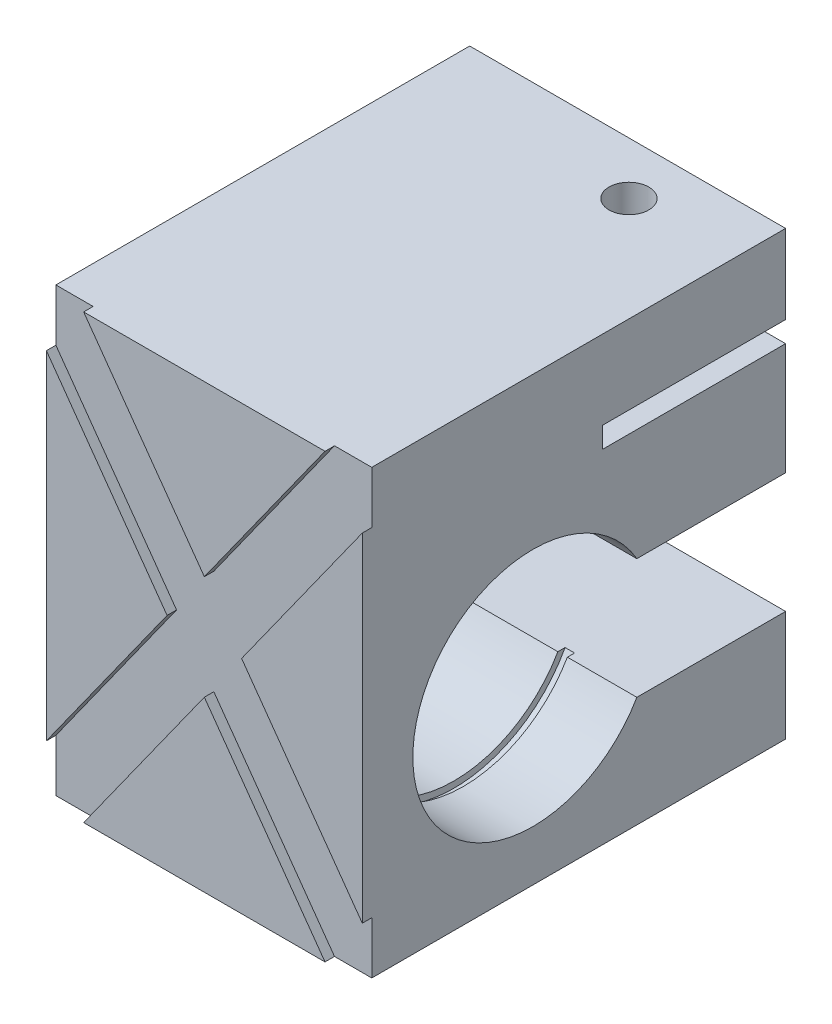
ISO-10303-21;
HEADER;
FILE_DESCRIPTION(('STEP AP214'),'2;1');
FILE_NAME('part.step','',(''),(''),'','','');
FILE_SCHEMA(('AUTOMOTIVE_DESIGN { 1 0 10303 214 1 1 1 1 }'));
ENDSEC;
DATA;
#1=APPLICATION_CONTEXT('core data for automotive mechanical design processes');
#2=APPLICATION_PROTOCOL_DEFINITION('international standard','automotive_design',2000,#1);
#3=PRODUCT_CONTEXT('',#1,'mechanical');
#4=PRODUCT('Part','Part','',(#3));
#5=PRODUCT_RELATED_PRODUCT_CATEGORY('part','',(#4));
#6=PRODUCT_DEFINITION_FORMATION('','',#4);
#7=PRODUCT_DEFINITION_CONTEXT('part definition',#1,'design');
#8=PRODUCT_DEFINITION('design','',#6,#7);
#9=PRODUCT_DEFINITION_SHAPE('','',#8);
#10=(LENGTH_UNIT() NAMED_UNIT(*) SI_UNIT(.MILLI.,.METRE.));
#11=(NAMED_UNIT(*) PLANE_ANGLE_UNIT() SI_UNIT($,.RADIAN.));
#12=(NAMED_UNIT(*) SI_UNIT($,.STERADIAN.) SOLID_ANGLE_UNIT());
#13=UNCERTAINTY_MEASURE_WITH_UNIT(LENGTH_MEASURE(1.E-05),#10,'distance_accuracy_value','');
#14=(GEOMETRIC_REPRESENTATION_CONTEXT(3) GLOBAL_UNCERTAINTY_ASSIGNED_CONTEXT((#13)) GLOBAL_UNIT_ASSIGNED_CONTEXT((#10,
#11,#12)) REPRESENTATION_CONTEXT('',''));
#15=CARTESIAN_POINT('',(0.,0.,0.));
#16=DIRECTION('',(0.,0.,1.));
#17=DIRECTION('',(1.,0.,0.));
#18=AXIS2_PLACEMENT_3D('',#15,#16,#17);
#19=CARTESIAN_POINT('',(0.,27.,6.50000000000001));
#20=DIRECTION('',(1.,0.,0.));
#21=DIRECTION('',(0.,0.,-1.));
#22=AXIS2_PLACEMENT_3D('',#19,#20,#21);
#23=CYLINDRICAL_SURFACE('',#22,19.);
#24=CARTESIAN_POINT('',(12.5,27.,6.50000000000001));
#25=DIRECTION('',(-1.,0.,0.));
#26=DIRECTION('',(0.,0.,-1.));
#27=AXIS2_PLACEMENT_3D('',#24,#25,#26);
#28=CIRCLE('',#27,19.);
#29=CARTESIAN_POINT('',(12.5,17.5,-9.95448267190432));
#30=VERTEX_POINT('',#29);
#31=CARTESIAN_POINT('',(12.5,36.5,-9.95448267190432));
#32=VERTEX_POINT('',#31);
#33=EDGE_CURVE('E618',#30,#32,#28,.T.);
#34=ORIENTED_EDGE('',*,*,#33,.T.);
#35=DIRECTION('',(1.,0.,0.));
#36=VECTOR('',#35,1.);
#37=CARTESIAN_POINT('',(0.,36.5,-9.95448267190432));
#38=LINE('',#37,#36);
#39=CARTESIAN_POINT('',(37.5,36.5,-9.95448267190432));
#40=VERTEX_POINT('',#39);
#41=EDGE_CURVE('E69',#32,#40,#38,.T.);
#42=ORIENTED_EDGE('',*,*,#41,.T.);
#43=CARTESIAN_POINT('',(37.5,27.,6.50000000000001));
#44=DIRECTION('',(-1.,0.,0.));
#45=DIRECTION('',(0.,0.,-1.));
#46=AXIS2_PLACEMENT_3D('',#43,#44,#45);
#47=CIRCLE('',#46,19.);
#48=CARTESIAN_POINT('',(37.5,17.5,-9.95448267190432));
#49=VERTEX_POINT('',#48);
#50=EDGE_CURVE('E595',#49,#40,#47,.T.);
#51=ORIENTED_EDGE('',*,*,#50,.F.);
#52=DIRECTION('',(1.,0.,0.));
#53=VECTOR('',#52,1.);
#54=CARTESIAN_POINT('',(0.,17.5,-9.95448267190432));
#55=LINE('',#54,#53);
#56=EDGE_CURVE('E285',#30,#49,#55,.T.);
#57=ORIENTED_EDGE('',*,*,#56,.F.);
#58=EDGE_LOOP('',(#34,#42,#51,#57));
#59=FACE_BOUND('',#58,.T.);
#60=ADVANCED_FACE('F45',(#59),#23,.F.);
#61=CARTESIAN_POINT('',(0.,36.5,-9.95448267190432));
#62=VERTEX_POINT('',#61);
#63=CARTESIAN_POINT('',(11.,36.5,-9.95448267190432));
#64=VERTEX_POINT('',#63);
#65=EDGE_CURVE('E275',#62,#64,#38,.T.);
#66=ORIENTED_EDGE('',*,*,#65,.T.);
#67=CARTESIAN_POINT('',(11.,27.,6.50000000000001));
#68=DIRECTION('',(-1.,0.,0.));
#69=DIRECTION('',(0.,0.,-1.));
#70=AXIS2_PLACEMENT_3D('',#67,#68,#69);
#71=CIRCLE('',#70,19.);
#72=CARTESIAN_POINT('',(11.,17.5,-9.95448267190432));
#73=VERTEX_POINT('',#72);
#74=EDGE_CURVE('E261',#73,#64,#71,.T.);
#75=ORIENTED_EDGE('',*,*,#74,.F.);
#76=CARTESIAN_POINT('',(0.,17.5,-9.95448267190432));
#77=VERTEX_POINT('',#76);
#78=EDGE_CURVE('E273',#77,#73,#55,.T.);
#79=ORIENTED_EDGE('',*,*,#78,.F.);
#80=CARTESIAN_POINT('',(0.,27.,6.50000000000001));
#81=DIRECTION('',(1.,0.,0.));
#82=DIRECTION('',(0.,0.,-1.));
#83=AXIS2_PLACEMENT_3D('',#80,#81,#82);
#84=CIRCLE('',#83,19.);
#85=EDGE_CURVE('E313',#62,#77,#84,.T.);
#86=ORIENTED_EDGE('',*,*,#85,.F.);
#87=EDGE_LOOP('',(#66,#75,#79,#86));
#88=FACE_BOUND('',#87,.T.);
#89=ADVANCED_FACE('F271',(#88),#23,.F.);
#90=CARTESIAN_POINT('',(0.,70.,33.5));
#91=DIRECTION('',(0.,-1.,0.));
#92=DIRECTION('',(0.,0.,-1.));
#93=AXIS2_PLACEMENT_3D('',#90,#91,#92);
#94=PLANE('',#93);
#95=DIRECTION('',(0.,0.,1.));
#96=VECTOR('',#95,1.);
#97=CARTESIAN_POINT('',(44.1012626740279,70.,32.));
#98=LINE('',#97,#96);
#99=CARTESIAN_POINT('',(44.1012626740279,70.,32.));
#100=VERTEX_POINT('',#99);
#101=CARTESIAN_POINT('',(44.1012626740279,70.,33.5));
#102=VERTEX_POINT('',#101);
#103=EDGE_CURVE('E450',#100,#102,#98,.T.);
#104=ORIENTED_EDGE('',*,*,#103,.F.);
#105=DIRECTION('',(-1.,0.,0.));
#106=VECTOR('',#105,1.);
#107=CARTESIAN_POINT('',(0.,70.,32.));
#108=LINE('',#107,#106);
#109=CARTESIAN_POINT('',(50.,70.,32.));
#110=VERTEX_POINT('',#109);
#111=EDGE_CURVE('E392',#110,#100,#108,.T.);
#112=ORIENTED_EDGE('',*,*,#111,.F.);
#113=DIRECTION('',(0.,0.,-1.));
#114=VECTOR('',#113,1.);
#115=CARTESIAN_POINT('',(50.,70.,33.5));
#116=LINE('',#115,#114);
#117=CARTESIAN_POINT('',(50.,70.,-33.5));
#118=VERTEX_POINT('',#117);
#119=EDGE_CURVE('E518',#110,#118,#116,.T.);
#120=ORIENTED_EDGE('',*,*,#119,.T.);
#121=DIRECTION('',(-1.,0.,0.));
#122=VECTOR('',#121,1.);
#123=CARTESIAN_POINT('',(0.,70.,-33.5));
#124=LINE('',#123,#122);
#125=CARTESIAN_POINT('',(0.,70.,-33.5));
#126=VERTEX_POINT('',#125);
#127=EDGE_CURVE('E485',#118,#126,#124,.T.);
#128=ORIENTED_EDGE('',*,*,#127,.T.);
#129=DIRECTION('',(0.,0.,-1.));
#130=VECTOR('',#129,1.);
#131=CARTESIAN_POINT('',(0.,70.,33.5));
#132=LINE('',#131,#130);
#133=CARTESIAN_POINT('',(0.,70.,32.));
#134=VERTEX_POINT('',#133);
#135=EDGE_CURVE('E497',#134,#126,#132,.T.);
#136=ORIENTED_EDGE('',*,*,#135,.F.);
#137=DIRECTION('',(-1.,0.,0.));
#138=VECTOR('',#137,1.);
#139=CARTESIAN_POINT('',(0.,70.,32.));
#140=LINE('',#139,#138);
#141=CARTESIAN_POINT('',(5.89873732597207,70.,32.));
#142=VERTEX_POINT('',#141);
#143=EDGE_CURVE('E403',#142,#134,#140,.T.);
#144=ORIENTED_EDGE('',*,*,#143,.F.);
#145=DIRECTION('',(0.,0.,1.));
#146=VECTOR('',#145,1.);
#147=CARTESIAN_POINT('',(5.89873732597207,70.,32.));
#148=LINE('',#147,#146);
#149=CARTESIAN_POINT('',(5.89873732597207,70.,33.5));
#150=VERTEX_POINT('',#149);
#151=EDGE_CURVE('E443',#142,#150,#148,.T.);
#152=ORIENTED_EDGE('',*,*,#151,.T.);
#153=DIRECTION('',(-1.,0.,0.));
#154=VECTOR('',#153,1.);
#155=CARTESIAN_POINT('',(0.,70.,33.5));
#156=LINE('',#155,#154);
#157=EDGE_CURVE('E493',#102,#150,#156,.T.);
#158=ORIENTED_EDGE('',*,*,#157,.F.);
#159=EDGE_LOOP('',(#104,#112,#120,#128,#136,#144,#152,#158));
#160=FACE_BOUND('',#159,.T.);
#161=CARTESIAN_POINT('',(33.5,70.,-25.2));
#162=DIRECTION('',(0.,1.,0.));
#163=DIRECTION('',(0.,0.,1.));
#164=AXIS2_PLACEMENT_3D('',#161,#162,#163);
#165=CIRCLE('',#164,3.14999999999999);
#166=CARTESIAN_POINT('',(33.5,70.,-22.05));
#167=VERTEX_POINT('',#166);
#168=EDGE_CURVE('E561',#167,#167,#165,.T.);
#169=ORIENTED_EDGE('',*,*,#168,.F.);
#170=EDGE_LOOP('',(#169));
#171=FACE_BOUND('',#170,.T.);
#172=ADVANCED_FACE('F666',(#160,#171),#94,.F.);
#173=CARTESIAN_POINT('',(0.,0.,-33.5));
#174=DIRECTION('',(0.,0.,-1.));
#175=DIRECTION('',(-1.,0.,0.));
#176=AXIS2_PLACEMENT_3D('',#173,#174,#175);
#177=PLANE('',#176);
#178=DIRECTION('',(1.,0.,0.));
#179=VECTOR('',#178,1.);
#180=CARTESIAN_POINT('',(0.,17.5,-33.5));
#181=LINE('',#180,#179);
#182=CARTESIAN_POINT('',(0.,17.5,-33.5));
#183=VERTEX_POINT('',#182);
#184=CARTESIAN_POINT('',(50.,17.5,-33.5));
#185=VERTEX_POINT('',#184);
#186=EDGE_CURVE('E284',#183,#185,#181,.T.);
#187=ORIENTED_EDGE('',*,*,#186,.T.);
#188=DIRECTION('',(0.,1.,0.));
#189=VECTOR('',#188,1.);
#190=CARTESIAN_POINT('',(50.,0.,-33.5));
#191=LINE('',#190,#189);
#192=CARTESIAN_POINT('',(50.,0.,-33.5));
#193=VERTEX_POINT('',#192);
#194=EDGE_CURVE('E508',#193,#185,#191,.T.);
#195=ORIENTED_EDGE('',*,*,#194,.F.);
#196=DIRECTION('',(1.,0.,0.));
#197=VECTOR('',#196,1.);
#198=CARTESIAN_POINT('',(0.,0.,-33.5));
#199=LINE('',#198,#197);
#200=CARTESIAN_POINT('',(0.,0.,-33.5));
#201=VERTEX_POINT('',#200);
#202=EDGE_CURVE('E502',#201,#193,#199,.T.);
#203=ORIENTED_EDGE('',*,*,#202,.F.);
#204=DIRECTION('',(0.,-1.,0.));
#205=VECTOR('',#204,1.);
#206=CARTESIAN_POINT('',(0.,0.,-33.5));
#207=LINE('',#206,#205);
#208=EDGE_CURVE('E442',#183,#201,#207,.T.);
#209=ORIENTED_EDGE('',*,*,#208,.F.);
#210=EDGE_LOOP('',(#187,#195,#203,#209));
#211=FACE_BOUND('',#210,.T.);
#212=ADVANCED_FACE('F538',(#211),#177,.T.);
#213=DIRECTION('',(1.,0.,0.));
#214=VECTOR('',#213,1.);
#215=CARTESIAN_POINT('',(0.,57.5,-33.5));
#216=LINE('',#215,#214);
#217=CARTESIAN_POINT('',(0.,57.5,-33.5));
#218=VERTEX_POINT('',#217);
#219=CARTESIAN_POINT('',(50.,57.5,-33.5));
#220=VERTEX_POINT('',#219);
#221=EDGE_CURVE('E344',#218,#220,#216,.T.);
#222=ORIENTED_EDGE('',*,*,#221,.F.);
#223=EDGE_CURVE('E498',#126,#218,#207,.T.);
#224=ORIENTED_EDGE('',*,*,#223,.F.);
#225=ORIENTED_EDGE('',*,*,#127,.F.);
#226=EDGE_CURVE('E507',#220,#118,#191,.T.);
#227=ORIENTED_EDGE('',*,*,#226,.F.);
#228=EDGE_LOOP('',(#222,#224,#225,#227));
#229=FACE_BOUND('',#228,.T.);
#230=ADVANCED_FACE('F661',(#229),#177,.T.);
#231=CARTESIAN_POINT('',(0.,0.,33.5));
#232=DIRECTION('',(1.,0.,0.));
#233=DIRECTION('',(0.,0.,-1.));
#234=AXIS2_PLACEMENT_3D('',#231,#232,#233);
#235=PLANE('',#234);
#236=ORIENTED_EDGE('',*,*,#85,.T.);
#237=DIRECTION('',(0.,0.,-1.));
#238=VECTOR('',#237,1.);
#239=CARTESIAN_POINT('',(0.,17.5,-9.95448267190432));
#240=LINE('',#239,#238);
#241=EDGE_CURVE('E281',#77,#183,#240,.T.);
#242=ORIENTED_EDGE('',*,*,#241,.T.);
#243=ORIENTED_EDGE('',*,*,#208,.T.);
#244=DIRECTION('',(0.,0.,-1.));
#245=VECTOR('',#244,1.);
#246=CARTESIAN_POINT('',(0.,0.,33.5));
#247=LINE('',#246,#245);
#248=CARTESIAN_POINT('',(0.,0.,32.));
#249=VERTEX_POINT('',#248);
#250=EDGE_CURVE('E11',#249,#201,#247,.T.);
#251=ORIENTED_EDGE('',*,*,#250,.F.);
#252=DIRECTION('',(0.,-1.,0.));
#253=VECTOR('',#252,1.);
#254=CARTESIAN_POINT('',(0.,0.,32.));
#255=LINE('',#254,#253);
#256=CARTESIAN_POINT('',(0.,8.25823225636094,32.));
#257=VERTEX_POINT('',#256);
#258=EDGE_CURVE('E360',#257,#249,#255,.T.);
#259=ORIENTED_EDGE('',*,*,#258,.F.);
#260=DIRECTION('',(0.,0.,1.));
#261=VECTOR('',#260,1.);
#262=CARTESIAN_POINT('',(0.,8.25823225636094,32.));
#263=LINE('',#262,#261);
#264=CARTESIAN_POINT('',(0.,8.25823225636094,33.5));
#265=VERTEX_POINT('',#264);
#266=EDGE_CURVE('E473',#257,#265,#263,.T.);
#267=ORIENTED_EDGE('',*,*,#266,.T.);
#268=DIRECTION('',(0.,-1.,0.));
#269=VECTOR('',#268,1.);
#270=CARTESIAN_POINT('',(0.,0.,33.5));
#271=LINE('',#270,#269);
#272=CARTESIAN_POINT('',(0.,61.7417677436391,33.5));
#273=VERTEX_POINT('',#272);
#274=EDGE_CURVE('E480',#273,#265,#271,.T.);
#275=ORIENTED_EDGE('',*,*,#274,.F.);
#276=DIRECTION('',(0.,0.,1.));
#277=VECTOR('',#276,1.);
#278=CARTESIAN_POINT('',(0.,61.7417677436391,32.));
#279=LINE('',#278,#277);
#280=CARTESIAN_POINT('',(0.,61.7417677436391,32.));
#281=VERTEX_POINT('',#280);
#282=EDGE_CURVE('E439',#281,#273,#279,.T.);
#283=ORIENTED_EDGE('',*,*,#282,.F.);
#284=DIRECTION('',(0.,-1.,0.));
#285=VECTOR('',#284,1.);
#286=CARTESIAN_POINT('',(0.,0.,32.));
#287=LINE('',#286,#285);
#288=EDGE_CURVE('E406',#134,#281,#287,.T.);
#289=ORIENTED_EDGE('',*,*,#288,.F.);
#290=ORIENTED_EDGE('',*,*,#135,.T.);
#291=ORIENTED_EDGE('',*,*,#223,.T.);
#292=DIRECTION('',(0.,0.,1.));
#293=VECTOR('',#292,1.);
#294=CARTESIAN_POINT('',(0.,57.5,-4.50000000000001));
#295=LINE('',#294,#293);
#296=CARTESIAN_POINT('',(0.,57.5,-4.50000000000001));
#297=VERTEX_POINT('',#296);
#298=EDGE_CURVE('E325',#218,#297,#295,.T.);
#299=ORIENTED_EDGE('',*,*,#298,.T.);
#300=DIRECTION('',(0.,-1.,0.));
#301=VECTOR('',#300,1.);
#302=CARTESIAN_POINT('',(0.,57.5,-4.50000000000001));
#303=LINE('',#302,#301);
#304=CARTESIAN_POINT('',(0.,54.2,-4.50000000000001));
#305=VERTEX_POINT('',#304);
#306=EDGE_CURVE('E316',#297,#305,#303,.T.);
#307=ORIENTED_EDGE('',*,*,#306,.T.);
#308=DIRECTION('',(0.,0.,-1.));
#309=VECTOR('',#308,1.);
#310=CARTESIAN_POINT('',(0.,54.2,-4.50000000000001));
#311=LINE('',#310,#309);
#312=CARTESIAN_POINT('',(0.,54.2,-33.5));
#313=VERTEX_POINT('',#312);
#314=EDGE_CURVE('E320',#305,#313,#311,.T.);
#315=ORIENTED_EDGE('',*,*,#314,.T.);
#316=CARTESIAN_POINT('',(0.,36.5,-33.5));
#317=VERTEX_POINT('',#316);
#318=EDGE_CURVE('E503',#313,#317,#207,.T.);
#319=ORIENTED_EDGE('',*,*,#318,.T.);
#320=DIRECTION('',(0.,0.,1.));
#321=VECTOR('',#320,1.);
#322=CARTESIAN_POINT('',(0.,36.5,-33.5));
#323=LINE('',#322,#321);
#324=EDGE_CURVE('E543',#317,#62,#323,.T.);
#325=ORIENTED_EDGE('',*,*,#324,.T.);
#326=EDGE_LOOP('',(#236,#242,#243,#251,#259,#267,#275,#283,#289,#290,#291,#299,#307,#315,#319,#325));
#327=FACE_BOUND('',#326,.T.);
#328=ADVANCED_FACE('F47',(#327),#235,.F.);
#329=CARTESIAN_POINT('',(0.,0.,33.5));
#330=DIRECTION('',(0.,1.,0.));
#331=DIRECTION('',(0.,0.,1.));
#332=AXIS2_PLACEMENT_3D('',#329,#330,#331);
#333=PLANE('',#332);
#334=DIRECTION('',(1.,0.,0.));
#335=VECTOR('',#334,1.);
#336=CARTESIAN_POINT('',(0.,0.,33.5));
#337=LINE('',#336,#335);
#338=CARTESIAN_POINT('',(5.89873732597205,0.,33.5));
#339=VERTEX_POINT('',#338);
#340=CARTESIAN_POINT('',(44.1012626740279,0.,33.5));
#341=VERTEX_POINT('',#340);
#342=EDGE_CURVE('E484',#339,#341,#337,.T.);
#343=ORIENTED_EDGE('',*,*,#342,.F.);
#344=DIRECTION('',(0.,0.,1.));
#345=VECTOR('',#344,1.);
#346=CARTESIAN_POINT('',(5.89873732597205,0.,32.));
#347=LINE('',#346,#345);
#348=CARTESIAN_POINT('',(5.89873732597205,0.,32.));
#349=VERTEX_POINT('',#348);
#350=EDGE_CURVE('E470',#349,#339,#347,.T.);
#351=ORIENTED_EDGE('',*,*,#350,.F.);
#352=DIRECTION('',(1.,0.,0.));
#353=VECTOR('',#352,1.);
#354=CARTESIAN_POINT('',(0.,0.,32.));
#355=LINE('',#354,#353);
#356=EDGE_CURVE('E363',#249,#349,#355,.T.);
#357=ORIENTED_EDGE('',*,*,#356,.F.);
#358=ORIENTED_EDGE('',*,*,#250,.T.);
#359=ORIENTED_EDGE('',*,*,#202,.T.);
#360=DIRECTION('',(0.,0.,-1.));
#361=VECTOR('',#360,1.);
#362=CARTESIAN_POINT('',(50.,0.,33.5));
#363=LINE('',#362,#361);
#364=CARTESIAN_POINT('',(50.,0.,32.));
#365=VERTEX_POINT('',#364);
#366=EDGE_CURVE('E54',#365,#193,#363,.T.);
#367=ORIENTED_EDGE('',*,*,#366,.F.);
#368=DIRECTION('',(1.,0.,0.));
#369=VECTOR('',#368,1.);
#370=CARTESIAN_POINT('',(0.,0.,32.));
#371=LINE('',#370,#369);
#372=CARTESIAN_POINT('',(44.1012626740279,0.,32.));
#373=VERTEX_POINT('',#372);
#374=EDGE_CURVE('E374',#373,#365,#371,.T.);
#375=ORIENTED_EDGE('',*,*,#374,.F.);
#376=DIRECTION('',(0.,0.,1.));
#377=VECTOR('',#376,1.);
#378=CARTESIAN_POINT('',(44.1012626740279,0.,32.));
#379=LINE('',#378,#377);
#380=EDGE_CURVE('E463',#373,#341,#379,.T.);
#381=ORIENTED_EDGE('',*,*,#380,.T.);
#382=EDGE_LOOP('',(#343,#351,#357,#358,#359,#367,#375,#381));
#383=FACE_BOUND('',#382,.T.);
#384=ADVANCED_FACE('F533',(#383),#333,.F.);
#385=CARTESIAN_POINT('',(0.,0.,33.5));
#386=DIRECTION('',(0.,0.,-1.));
#387=DIRECTION('',(-1.,0.,0.));
#388=AXIS2_PLACEMENT_3D('',#385,#386,#387);
#389=PLANE('',#388);
#390=ORIENTED_EDGE('',*,*,#157,.T.);
#391=DIRECTION('',(-0.581238193719096,0.813733471206735,0.));
#392=VECTOR('',#391,1.);
#393=CARTESIAN_POINT('',(37.0140287699004,26.4385919785003,33.5));
#394=LINE('',#393,#392);
#395=CARTESIAN_POINT('',(25.,43.2582322563609,33.5));
#396=VERTEX_POINT('',#395);
#397=EDGE_CURVE('E357',#396,#150,#394,.T.);
#398=ORIENTED_EDGE('',*,*,#397,.F.);
#399=DIRECTION('',(0.581238193719097,0.813733471206735,0.));
#400=VECTOR('',#399,1.);
#401=CARTESIAN_POINT('',(-3.90592066179234,2.78994332985167,33.5));
#402=LINE('',#401,#400);
#403=EDGE_CURVE('E433',#396,#102,#402,.T.);
#404=ORIENTED_EDGE('',*,*,#403,.T.);
#405=EDGE_LOOP('',(#390,#398,#404));
#406=FACE_BOUND('',#405,.T.);
#407=ADVANCED_FACE('F711',(#406),#389,.F.);
#408=DIRECTION('',(-0.581238193719096,0.813733471206735,0.));
#409=VECTOR('',#408,1.);
#410=CARTESIAN_POINT('',(29.2021874463158,20.858705318797,33.5));
#411=LINE('',#410,#409);
#412=CARTESIAN_POINT('',(25.,26.7417677436391,33.5));
#413=VERTEX_POINT('',#412);
#414=EDGE_CURVE('E422',#341,#413,#411,.T.);
#415=ORIENTED_EDGE('',*,*,#414,.T.);
#416=DIRECTION('',(0.581238193719097,0.813733471206735,0.));
#417=VECTOR('',#416,1.);
#418=CARTESIAN_POINT('',(3.9059206617923,-2.78994332985165,33.5));
#419=LINE('',#418,#417);
#420=EDGE_CURVE('E418',#339,#413,#419,.T.);
#421=ORIENTED_EDGE('',*,*,#420,.F.);
#422=ORIENTED_EDGE('',*,*,#342,.T.);
#423=EDGE_LOOP('',(#415,#421,#422));
#424=FACE_BOUND('',#423,.T.);
#425=ADVANCED_FACE('F690',(#424),#389,.F.);
#426=DIRECTION('',(-0.581238193719096,0.813733471206735,0.));
#427=VECTOR('',#426,1.);
#428=CARTESIAN_POINT('',(29.2021874463158,20.858705318797,33.5));
#429=LINE('',#428,#427);
#430=CARTESIAN_POINT('',(19.1012626740279,35.,33.5));
#431=VERTEX_POINT('',#430);
#432=EDGE_CURVE('E343',#431,#273,#429,.T.);
#433=ORIENTED_EDGE('',*,*,#432,.T.);
#434=ORIENTED_EDGE('',*,*,#274,.T.);
#435=DIRECTION('',(0.581238193719097,0.813733471206735,0.));
#436=VECTOR('',#435,1.);
#437=CARTESIAN_POINT('',(-3.90592066179234,2.78994332985167,33.5));
#438=LINE('',#437,#436);
#439=EDGE_CURVE('E414',#265,#431,#438,.T.);
#440=ORIENTED_EDGE('',*,*,#439,.T.);
#441=EDGE_LOOP('',(#433,#434,#440));
#442=FACE_BOUND('',#441,.T.);
#443=ADVANCED_FACE('F704',(#442),#389,.F.);
#444=CARTESIAN_POINT('',(50.,0.,33.5));
#445=DIRECTION('',(-1.,0.,0.));
#446=DIRECTION('',(0.,0.,1.));
#447=AXIS2_PLACEMENT_3D('',#444,#445,#446);
#448=PLANE('',#447);
#449=ORIENTED_EDGE('',*,*,#194,.T.);
#450=DIRECTION('',(0.,0.,-1.));
#451=VECTOR('',#450,1.);
#452=CARTESIAN_POINT('',(50.,17.5,-9.95448267190432));
#453=LINE('',#452,#451);
#454=CARTESIAN_POINT('',(50.,17.5,-9.95448267190432));
#455=VERTEX_POINT('',#454);
#456=EDGE_CURVE('E539',#455,#185,#453,.T.);
#457=ORIENTED_EDGE('',*,*,#456,.F.);
#458=CARTESIAN_POINT('',(50.,27.,6.50000000000001));
#459=DIRECTION('',(1.,0.,0.));
#460=DIRECTION('',(0.,0.,-1.));
#461=AXIS2_PLACEMENT_3D('',#458,#459,#460);
#462=CIRCLE('',#461,19.);
#463=CARTESIAN_POINT('',(50.,36.5,-9.95448267190432));
#464=VERTEX_POINT('',#463);
#465=EDGE_CURVE('E553',#464,#455,#462,.T.);
#466=ORIENTED_EDGE('',*,*,#465,.F.);
#467=DIRECTION('',(0.,0.,1.));
#468=VECTOR('',#467,1.);
#469=CARTESIAN_POINT('',(50.,36.5,-33.5));
#470=LINE('',#469,#468);
#471=CARTESIAN_POINT('',(50.,36.5,-33.5));
#472=VERTEX_POINT('',#471);
#473=EDGE_CURVE('E550',#472,#464,#470,.T.);
#474=ORIENTED_EDGE('',*,*,#473,.F.);
#475=CARTESIAN_POINT('',(50.,54.2,-33.5));
#476=VERTEX_POINT('',#475);
#477=EDGE_CURVE('E512',#472,#476,#191,.T.);
#478=ORIENTED_EDGE('',*,*,#477,.T.);
#479=DIRECTION('',(0.,0.,-1.));
#480=VECTOR('',#479,1.);
#481=CARTESIAN_POINT('',(50.,54.2,-4.50000000000001));
#482=LINE('',#481,#480);
#483=CARTESIAN_POINT('',(50.,54.2,-4.50000000000001));
#484=VERTEX_POINT('',#483);
#485=EDGE_CURVE('E333',#484,#476,#482,.T.);
#486=ORIENTED_EDGE('',*,*,#485,.F.);
#487=DIRECTION('',(0.,-1.,0.));
#488=VECTOR('',#487,1.);
#489=CARTESIAN_POINT('',(50.,57.5,-4.50000000000001));
#490=LINE('',#489,#488);
#491=CARTESIAN_POINT('',(50.,57.5,-4.50000000000001));
#492=VERTEX_POINT('',#491);
#493=EDGE_CURVE('E291',#492,#484,#490,.T.);
#494=ORIENTED_EDGE('',*,*,#493,.F.);
#495=DIRECTION('',(0.,0.,1.));
#496=VECTOR('',#495,1.);
#497=CARTESIAN_POINT('',(50.,57.5,-4.50000000000001));
#498=LINE('',#497,#496);
#499=EDGE_CURVE('E321',#220,#492,#498,.T.);
#500=ORIENTED_EDGE('',*,*,#499,.F.);
#501=ORIENTED_EDGE('',*,*,#226,.T.);
#502=ORIENTED_EDGE('',*,*,#119,.F.);
#503=DIRECTION('',(0.,1.,0.));
#504=VECTOR('',#503,1.);
#505=CARTESIAN_POINT('',(50.,0.,32.));
#506=LINE('',#505,#504);
#507=CARTESIAN_POINT('',(50.,61.7417677436391,32.));
#508=VERTEX_POINT('',#507);
#509=EDGE_CURVE('E389',#508,#110,#506,.T.);
#510=ORIENTED_EDGE('',*,*,#509,.F.);
#511=DIRECTION('',(0.,0.,1.));
#512=VECTOR('',#511,1.);
#513=CARTESIAN_POINT('',(50.,61.7417677436391,32.));
#514=LINE('',#513,#512);
#515=CARTESIAN_POINT('',(50.,61.7417677436391,33.5));
#516=VERTEX_POINT('',#515);
#517=EDGE_CURVE('E453',#508,#516,#514,.T.);
#518=ORIENTED_EDGE('',*,*,#517,.T.);
#519=DIRECTION('',(0.,1.,0.));
#520=VECTOR('',#519,1.);
#521=CARTESIAN_POINT('',(50.,0.,33.5));
#522=LINE('',#521,#520);
#523=CARTESIAN_POINT('',(50.,8.25823225636088,33.5));
#524=VERTEX_POINT('',#523);
#525=EDGE_CURVE('E489',#524,#516,#522,.T.);
#526=ORIENTED_EDGE('',*,*,#525,.F.);
#527=DIRECTION('',(0.,0.,1.));
#528=VECTOR('',#527,1.);
#529=CARTESIAN_POINT('',(50.,8.25823225636088,32.));
#530=LINE('',#529,#528);
#531=CARTESIAN_POINT('',(50.,8.25823225636088,32.));
#532=VERTEX_POINT('',#531);
#533=EDGE_CURVE('E460',#532,#524,#530,.T.);
#534=ORIENTED_EDGE('',*,*,#533,.F.);
#535=DIRECTION('',(0.,1.,0.));
#536=VECTOR('',#535,1.);
#537=CARTESIAN_POINT('',(50.,0.,32.));
#538=LINE('',#537,#536);
#539=EDGE_CURVE('E377',#365,#532,#538,.T.);
#540=ORIENTED_EDGE('',*,*,#539,.F.);
#541=ORIENTED_EDGE('',*,*,#366,.T.);
#542=EDGE_LOOP('',(#449,#457,#466,#474,#478,#486,#494,#500,#501,#502,#510,#518,#526,#534,#540,#541));
#543=FACE_BOUND('',#542,.T.);
#544=ADVANCED_FACE('F525',(#543),#448,.F.);
#545=ORIENTED_EDGE('',*,*,#525,.T.);
#546=DIRECTION('',(0.581238193719097,0.813733471206735,0.));
#547=VECTOR('',#546,1.);
#548=CARTESIAN_POINT('',(3.9059206617923,-2.78994332985165,33.5));
#549=LINE('',#548,#547);
#550=CARTESIAN_POINT('',(30.8987373259721,35.,33.5));
#551=VERTEX_POINT('',#550);
#552=EDGE_CURVE('E430',#551,#516,#549,.T.);
#553=ORIENTED_EDGE('',*,*,#552,.F.);
#554=DIRECTION('',(-0.581238193719096,0.813733471206735,0.));
#555=VECTOR('',#554,1.);
#556=CARTESIAN_POINT('',(37.0140287699004,26.4385919785003,33.5));
#557=LINE('',#556,#555);
#558=EDGE_CURVE('E426',#524,#551,#557,.T.);
#559=ORIENTED_EDGE('',*,*,#558,.F.);
#560=EDGE_LOOP('',(#545,#553,#559));
#561=FACE_BOUND('',#560,.T.);
#562=ADVANCED_FACE('F682',(#561),#389,.F.);
#563=DIRECTION('',(1.,0.,0.));
#564=VECTOR('',#563,1.);
#565=CARTESIAN_POINT('',(0.,36.5,-33.5));
#566=LINE('',#565,#564);
#567=EDGE_CURVE('E303',#317,#472,#566,.T.);
#568=ORIENTED_EDGE('',*,*,#567,.F.);
#569=ORIENTED_EDGE('',*,*,#318,.F.);
#570=DIRECTION('',(1.,0.,0.));
#571=VECTOR('',#570,1.);
#572=CARTESIAN_POINT('',(0.,54.2,-33.5));
#573=LINE('',#572,#571);
#574=EDGE_CURVE('E347',#313,#476,#573,.T.);
#575=ORIENTED_EDGE('',*,*,#574,.T.);
#576=ORIENTED_EDGE('',*,*,#477,.F.);
#577=EDGE_LOOP('',(#568,#569,#575,#576));
#578=FACE_BOUND('',#577,.T.);
#579=ADVANCED_FACE('F640',(#578),#177,.T.);
#580=CARTESIAN_POINT('',(29.2021874463158,20.858705318797,32.));
#581=DIRECTION('',(0.813733471206735,0.581238193719096,0.));
#582=DIRECTION('',(-0.581238193719096,0.813733471206735,0.));
#583=AXIS2_PLACEMENT_3D('',#580,#581,#582);
#584=PLANE('',#583);
#585=ORIENTED_EDGE('',*,*,#432,.F.);
#586=DIRECTION('',(0.,0.,1.));
#587=VECTOR('',#586,1.);
#588=CARTESIAN_POINT('',(19.1012626740279,35.,32.));
#589=LINE('',#588,#587);
#590=CARTESIAN_POINT('',(19.1012626740279,35.,32.));
#591=VERTEX_POINT('',#590);
#592=EDGE_CURVE('E410',#591,#431,#589,.T.);
#593=ORIENTED_EDGE('',*,*,#592,.F.);
#594=DIRECTION('',(-0.581238193719096,0.813733471206735,0.));
#595=VECTOR('',#594,1.);
#596=CARTESIAN_POINT('',(29.2021874463158,20.858705318797,32.));
#597=LINE('',#596,#595);
#598=EDGE_CURVE('E353',#591,#281,#597,.T.);
#599=ORIENTED_EDGE('',*,*,#598,.T.);
#600=ORIENTED_EDGE('',*,*,#282,.T.);
#601=EDGE_LOOP('',(#585,#593,#599,#600));
#602=FACE_BOUND('',#601,.T.);
#603=ADVANCED_FACE('F701',(#602),#584,.T.);
#604=CARTESIAN_POINT('',(37.0140287699004,26.4385919785003,32.));
#605=DIRECTION('',(0.813733471206735,0.581238193719096,0.));
#606=DIRECTION('',(-0.581238193719096,0.813733471206735,0.));
#607=AXIS2_PLACEMENT_3D('',#604,#605,#606);
#608=PLANE('',#607);
#609=ORIENTED_EDGE('',*,*,#397,.T.);
#610=ORIENTED_EDGE('',*,*,#151,.F.);
#611=DIRECTION('',(-0.581238193719096,0.813733471206735,0.));
#612=VECTOR('',#611,1.);
#613=CARTESIAN_POINT('',(37.0140287699004,26.4385919785003,32.));
#614=LINE('',#613,#612);
#615=CARTESIAN_POINT('',(25.,43.2582322563609,32.));
#616=VERTEX_POINT('',#615);
#617=EDGE_CURVE('E399',#616,#142,#614,.T.);
#618=ORIENTED_EDGE('',*,*,#617,.F.);
#619=DIRECTION('',(0.,0.,1.));
#620=VECTOR('',#619,1.);
#621=CARTESIAN_POINT('',(25.,43.2582322563609,32.));
#622=LINE('',#621,#620);
#623=EDGE_CURVE('E447',#616,#396,#622,.T.);
#624=ORIENTED_EDGE('',*,*,#623,.T.);
#625=EDGE_LOOP('',(#609,#610,#618,#624));
#626=FACE_BOUND('',#625,.T.);
#627=ADVANCED_FACE('F715',(#626),#608,.F.);
#628=CARTESIAN_POINT('',(-3.90592066179234,2.78994332985167,32.));
#629=DIRECTION('',(0.813733471206735,-0.581238193719096,0.));
#630=DIRECTION('',(0.581238193719096,0.813733471206735,0.));
#631=AXIS2_PLACEMENT_3D('',#628,#629,#630);
#632=PLANE('',#631);
#633=ORIENTED_EDGE('',*,*,#403,.F.);
#634=ORIENTED_EDGE('',*,*,#623,.F.);
#635=DIRECTION('',(0.581238193719097,0.813733471206735,0.));
#636=VECTOR('',#635,1.);
#637=CARTESIAN_POINT('',(-3.90592066179234,2.78994332985167,32.));
#638=LINE('',#637,#636);
#639=EDGE_CURVE('E396',#616,#100,#638,.T.);
#640=ORIENTED_EDGE('',*,*,#639,.T.);
#641=ORIENTED_EDGE('',*,*,#103,.T.);
#642=EDGE_LOOP('',(#633,#634,#640,#641));
#643=FACE_BOUND('',#642,.T.);
#644=ADVANCED_FACE('F714',(#643),#632,.T.);
#645=CARTESIAN_POINT('',(3.9059206617923,-2.78994332985165,32.));
#646=DIRECTION('',(0.813733471206735,-0.581238193719097,0.));
#647=DIRECTION('',(0.581238193719097,0.813733471206735,0.));
#648=AXIS2_PLACEMENT_3D('',#645,#646,#647);
#649=PLANE('',#648);
#650=ORIENTED_EDGE('',*,*,#552,.T.);
#651=ORIENTED_EDGE('',*,*,#517,.F.);
#652=DIRECTION('',(0.581238193719097,0.813733471206735,0.));
#653=VECTOR('',#652,1.);
#654=CARTESIAN_POINT('',(3.9059206617923,-2.78994332985165,32.));
#655=LINE('',#654,#653);
#656=CARTESIAN_POINT('',(30.8987373259721,35.,32.));
#657=VERTEX_POINT('',#656);
#658=EDGE_CURVE('E385',#657,#508,#655,.T.);
#659=ORIENTED_EDGE('',*,*,#658,.F.);
#660=DIRECTION('',(0.,0.,1.));
#661=VECTOR('',#660,1.);
#662=CARTESIAN_POINT('',(30.8987373259721,35.,32.));
#663=LINE('',#662,#661);
#664=EDGE_CURVE('E457',#657,#551,#663,.T.);
#665=ORIENTED_EDGE('',*,*,#664,.T.);
#666=EDGE_LOOP('',(#650,#651,#659,#665));
#667=FACE_BOUND('',#666,.T.);
#668=ADVANCED_FACE('F678',(#667),#649,.F.);
#669=CARTESIAN_POINT('',(37.0140287699004,26.4385919785003,32.));
#670=DIRECTION('',(0.813733471206735,0.581238193719096,0.));
#671=DIRECTION('',(-0.581238193719096,0.813733471206735,0.));
#672=AXIS2_PLACEMENT_3D('',#669,#670,#671);
#673=PLANE('',#672);
#674=ORIENTED_EDGE('',*,*,#558,.T.);
#675=ORIENTED_EDGE('',*,*,#664,.F.);
#676=DIRECTION('',(-0.581238193719096,0.813733471206735,0.));
#677=VECTOR('',#676,1.);
#678=CARTESIAN_POINT('',(37.0140287699004,26.4385919785003,32.));
#679=LINE('',#678,#677);
#680=EDGE_CURVE('E381',#532,#657,#679,.T.);
#681=ORIENTED_EDGE('',*,*,#680,.F.);
#682=ORIENTED_EDGE('',*,*,#533,.T.);
#683=EDGE_LOOP('',(#674,#675,#681,#682));
#684=FACE_BOUND('',#683,.T.);
#685=ADVANCED_FACE('F684',(#684),#673,.F.);
#686=CARTESIAN_POINT('',(29.2021874463158,20.858705318797,32.));
#687=DIRECTION('',(0.813733471206735,0.581238193719096,0.));
#688=DIRECTION('',(-0.581238193719096,0.813733471206735,0.));
#689=AXIS2_PLACEMENT_3D('',#686,#687,#688);
#690=PLANE('',#689);
#691=ORIENTED_EDGE('',*,*,#414,.F.);
#692=ORIENTED_EDGE('',*,*,#380,.F.);
#693=DIRECTION('',(-0.581238193719096,0.813733471206735,0.));
#694=VECTOR('',#693,1.);
#695=CARTESIAN_POINT('',(29.2021874463158,20.858705318797,32.));
#696=LINE('',#695,#694);
#697=CARTESIAN_POINT('',(25.,26.7417677436391,32.));
#698=VERTEX_POINT('',#697);
#699=EDGE_CURVE('E371',#373,#698,#696,.T.);
#700=ORIENTED_EDGE('',*,*,#699,.T.);
#701=DIRECTION('',(0.,0.,1.));
#702=VECTOR('',#701,1.);
#703=CARTESIAN_POINT('',(25.,26.7417677436391,32.));
#704=LINE('',#703,#702);
#705=EDGE_CURVE('E467',#698,#413,#704,.T.);
#706=ORIENTED_EDGE('',*,*,#705,.T.);
#707=EDGE_LOOP('',(#691,#692,#700,#706));
#708=FACE_BOUND('',#707,.T.);
#709=ADVANCED_FACE('F835',(#708),#690,.T.);
#710=CARTESIAN_POINT('',(3.9059206617923,-2.78994332985165,32.));
#711=DIRECTION('',(0.813733471206735,-0.581238193719097,0.));
#712=DIRECTION('',(0.581238193719097,0.813733471206735,0.));
#713=AXIS2_PLACEMENT_3D('',#710,#711,#712);
#714=PLANE('',#713);
#715=ORIENTED_EDGE('',*,*,#420,.T.);
#716=ORIENTED_EDGE('',*,*,#705,.F.);
#717=DIRECTION('',(0.581238193719097,0.813733471206735,0.));
#718=VECTOR('',#717,1.);
#719=CARTESIAN_POINT('',(3.9059206617923,-2.78994332985165,32.));
#720=LINE('',#719,#718);
#721=EDGE_CURVE('E367',#349,#698,#720,.T.);
#722=ORIENTED_EDGE('',*,*,#721,.F.);
#723=ORIENTED_EDGE('',*,*,#350,.T.);
#724=EDGE_LOOP('',(#715,#716,#722,#723));
#725=FACE_BOUND('',#724,.T.);
#726=ADVANCED_FACE('F693',(#725),#714,.F.);
#727=CARTESIAN_POINT('',(-3.90592066179234,2.78994332985167,32.));
#728=DIRECTION('',(0.813733471206735,-0.581238193719096,0.));
#729=DIRECTION('',(0.581238193719096,0.813733471206735,0.));
#730=AXIS2_PLACEMENT_3D('',#727,#728,#729);
#731=PLANE('',#730);
#732=ORIENTED_EDGE('',*,*,#439,.F.);
#733=ORIENTED_EDGE('',*,*,#266,.F.);
#734=DIRECTION('',(0.581238193719097,0.813733471206735,0.));
#735=VECTOR('',#734,1.);
#736=CARTESIAN_POINT('',(-3.90592066179234,2.78994332985167,32.));
#737=LINE('',#736,#735);
#738=EDGE_CURVE('E356',#257,#591,#737,.T.);
#739=ORIENTED_EDGE('',*,*,#738,.T.);
#740=ORIENTED_EDGE('',*,*,#592,.T.);
#741=EDGE_LOOP('',(#732,#733,#739,#740));
#742=FACE_BOUND('',#741,.T.);
#743=ADVANCED_FACE('F699',(#742),#731,.T.);
#744=CARTESIAN_POINT('',(0.,0.,32.));
#745=DIRECTION('',(0.,0.,1.));
#746=DIRECTION('',(1.,0.,0.));
#747=AXIS2_PLACEMENT_3D('',#744,#745,#746);
#748=PLANE('',#747);
#749=ORIENTED_EDGE('',*,*,#598,.F.);
#750=ORIENTED_EDGE('',*,*,#738,.F.);
#751=ORIENTED_EDGE('',*,*,#258,.T.);
#752=ORIENTED_EDGE('',*,*,#356,.T.);
#753=ORIENTED_EDGE('',*,*,#721,.T.);
#754=ORIENTED_EDGE('',*,*,#699,.F.);
#755=ORIENTED_EDGE('',*,*,#374,.T.);
#756=ORIENTED_EDGE('',*,*,#539,.T.);
#757=ORIENTED_EDGE('',*,*,#680,.T.);
#758=ORIENTED_EDGE('',*,*,#658,.T.);
#759=ORIENTED_EDGE('',*,*,#509,.T.);
#760=ORIENTED_EDGE('',*,*,#111,.T.);
#761=ORIENTED_EDGE('',*,*,#639,.F.);
#762=ORIENTED_EDGE('',*,*,#617,.T.);
#763=ORIENTED_EDGE('',*,*,#143,.T.);
#764=ORIENTED_EDGE('',*,*,#288,.T.);
#765=EDGE_LOOP('',(#749,#750,#751,#752,#753,#754,#755,#756,#757,#758,#759,#760,#761,#762,#763,#764));
#766=FACE_BOUND('',#765,.T.);
#767=ADVANCED_FACE('F674',(#766),#748,.T.);
#768=CARTESIAN_POINT('',(0.,57.5,-4.50000000000001));
#769=DIRECTION('',(0.,0.,1.));
#770=DIRECTION('',(1.,0.,0.));
#771=AXIS2_PLACEMENT_3D('',#768,#769,#770);
#772=PLANE('',#771);
#773=ORIENTED_EDGE('',*,*,#493,.T.);
#774=DIRECTION('',(1.,0.,0.));
#775=VECTOR('',#774,1.);
#776=CARTESIAN_POINT('',(0.,54.2,-4.50000000000001));
#777=LINE('',#776,#775);
#778=EDGE_CURVE('E329',#305,#484,#777,.T.);
#779=ORIENTED_EDGE('',*,*,#778,.F.);
#780=ORIENTED_EDGE('',*,*,#306,.F.);
#781=DIRECTION('',(1.,0.,0.));
#782=VECTOR('',#781,1.);
#783=CARTESIAN_POINT('',(0.,57.5,-4.50000000000001));
#784=LINE('',#783,#782);
#785=EDGE_CURVE('E340',#297,#492,#784,.T.);
#786=ORIENTED_EDGE('',*,*,#785,.T.);
#787=EDGE_LOOP('',(#773,#779,#780,#786));
#788=FACE_BOUND('',#787,.T.);
#789=ADVANCED_FACE('F653',(#788),#772,.F.);
#790=CARTESIAN_POINT('',(0.,57.5,-4.50000000000001));
#791=DIRECTION('',(0.,1.,0.));
#792=DIRECTION('',(0.,0.,1.));
#793=AXIS2_PLACEMENT_3D('',#790,#791,#792);
#794=PLANE('',#793);
#795=CARTESIAN_POINT('',(33.5,57.5,-25.2));
#796=DIRECTION('',(0.,1.,0.));
#797=DIRECTION('',(0.,0.,1.));
#798=AXIS2_PLACEMENT_3D('',#795,#796,#797);
#799=CIRCLE('',#798,3.14999999999999);
#800=CARTESIAN_POINT('',(33.5,57.5,-22.05));
#801=VERTEX_POINT('',#800);
#802=EDGE_CURVE('E554',#801,#801,#799,.T.);
#803=ORIENTED_EDGE('',*,*,#802,.T.);
#804=EDGE_LOOP('',(#803));
#805=FACE_BOUND('',#804,.T.);
#806=ORIENTED_EDGE('',*,*,#499,.T.);
#807=ORIENTED_EDGE('',*,*,#785,.F.);
#808=ORIENTED_EDGE('',*,*,#298,.F.);
#809=ORIENTED_EDGE('',*,*,#221,.T.);
#810=EDGE_LOOP('',(#806,#807,#808,#809));
#811=FACE_BOUND('',#810,.T.);
#812=ADVANCED_FACE('F874',(#805,#811),#794,.F.);
#813=CARTESIAN_POINT('',(0.,54.2,-4.50000000000001));
#814=DIRECTION('',(0.,-1.,0.));
#815=DIRECTION('',(0.,0.,-1.));
#816=AXIS2_PLACEMENT_3D('',#813,#814,#815);
#817=PLANE('',#816);
#818=ORIENTED_EDGE('',*,*,#485,.T.);
#819=ORIENTED_EDGE('',*,*,#574,.F.);
#820=ORIENTED_EDGE('',*,*,#314,.F.);
#821=ORIENTED_EDGE('',*,*,#778,.T.);
#822=EDGE_LOOP('',(#818,#819,#820,#821));
#823=FACE_BOUND('',#822,.T.);
#824=ADVANCED_FACE('F650',(#823),#817,.F.);
#825=CARTESIAN_POINT('',(0.,17.5,-9.95448267190432));
#826=DIRECTION('',(0.,-1.,0.));
#827=DIRECTION('',(0.,0.,-1.));
#828=AXIS2_PLACEMENT_3D('',#825,#826,#827);
#829=PLANE('',#828);
#830=ORIENTED_EDGE('',*,*,#78,.T.);
#831=DIRECTION('',(0.,0.,1.));
#832=VECTOR('',#831,1.);
#833=CARTESIAN_POINT('',(11.,17.5,-9.95448267190432));
#834=LINE('',#833,#832);
#835=CARTESIAN_POINT('',(11.,17.5,-11.099715906798));
#836=VERTEX_POINT('',#835);
#837=EDGE_CURVE('E257',#836,#73,#834,.T.);
#838=ORIENTED_EDGE('',*,*,#837,.F.);
#839=DIRECTION('',(1.,0.,0.));
#840=VECTOR('',#839,1.);
#841=CARTESIAN_POINT('',(11.,17.5,-11.099715906798));
#842=LINE('',#841,#840);
#843=CARTESIAN_POINT('',(12.5,17.5,-11.099715906798));
#844=VERTEX_POINT('',#843);
#845=EDGE_CURVE('E598',#836,#844,#842,.T.);
#846=ORIENTED_EDGE('',*,*,#845,.T.);
#847=DIRECTION('',(0.,0.,1.));
#848=VECTOR('',#847,1.);
#849=CARTESIAN_POINT('',(12.5,17.5,-9.95448267190432));
#850=LINE('',#849,#848);
#851=EDGE_CURVE('E614',#844,#30,#850,.T.);
#852=ORIENTED_EDGE('',*,*,#851,.T.);
#853=ORIENTED_EDGE('',*,*,#56,.T.);
#854=DIRECTION('',(0.,0.,1.));
#855=VECTOR('',#854,1.);
#856=CARTESIAN_POINT('',(37.5,17.5,-9.95448267190432));
#857=LINE('',#856,#855);
#858=CARTESIAN_POINT('',(37.5,17.5,-11.099715906798));
#859=VERTEX_POINT('',#858);
#860=EDGE_CURVE('E585',#859,#49,#857,.T.);
#861=ORIENTED_EDGE('',*,*,#860,.F.);
#862=DIRECTION('',(-1.,0.,0.));
#863=VECTOR('',#862,1.);
#864=CARTESIAN_POINT('',(39.,17.5,-11.099715906798));
#865=LINE('',#864,#863);
#866=CARTESIAN_POINT('',(39.,17.5,-11.099715906798));
#867=VERTEX_POINT('',#866);
#868=EDGE_CURVE('E568',#867,#859,#865,.T.);
#869=ORIENTED_EDGE('',*,*,#868,.F.);
#870=DIRECTION('',(0.,0.,1.));
#871=VECTOR('',#870,1.);
#872=CARTESIAN_POINT('',(39.,17.5,-9.95448267190432));
#873=LINE('',#872,#871);
#874=CARTESIAN_POINT('',(39.,17.5,-9.95448267190432));
#875=VERTEX_POINT('',#874);
#876=EDGE_CURVE('E572',#867,#875,#873,.T.);
#877=ORIENTED_EDGE('',*,*,#876,.T.);
#878=EDGE_CURVE('E287',#875,#455,#55,.T.);
#879=ORIENTED_EDGE('',*,*,#878,.T.);
#880=ORIENTED_EDGE('',*,*,#456,.T.);
#881=ORIENTED_EDGE('',*,*,#186,.F.);
#882=ORIENTED_EDGE('',*,*,#241,.F.);
#883=EDGE_LOOP('',(#830,#838,#846,#852,#853,#861,#869,#877,#879,#880,#881,#882));
#884=FACE_BOUND('',#883,.T.);
#885=ADVANCED_FACE('F279',(#884),#829,.F.);
#886=ORIENTED_EDGE('',*,*,#878,.F.);
#887=CARTESIAN_POINT('',(39.,27.,6.50000000000001));
#888=DIRECTION('',(-1.,0.,0.));
#889=DIRECTION('',(0.,0.,-1.));
#890=AXIS2_PLACEMENT_3D('',#887,#888,#889);
#891=CIRCLE('',#890,19.);
#892=CARTESIAN_POINT('',(39.,36.5,-9.95448267190432));
#893=VERTEX_POINT('',#892);
#894=EDGE_CURVE('E582',#875,#893,#891,.T.);
#895=ORIENTED_EDGE('',*,*,#894,.T.);
#896=EDGE_CURVE('E299',#893,#464,#38,.T.);
#897=ORIENTED_EDGE('',*,*,#896,.T.);
#898=ORIENTED_EDGE('',*,*,#465,.T.);
#899=EDGE_LOOP('',(#886,#895,#897,#898));
#900=FACE_BOUND('',#899,.T.);
#901=ADVANCED_FACE('F727',(#900),#23,.F.);
#902=CARTESIAN_POINT('',(0.,36.5,-33.5));
#903=DIRECTION('',(0.,1.,0.));
#904=DIRECTION('',(0.,0.,1.));
#905=AXIS2_PLACEMENT_3D('',#902,#903,#904);
#906=PLANE('',#905);
#907=DIRECTION('',(1.,0.,0.));
#908=VECTOR('',#907,1.);
#909=CARTESIAN_POINT('',(11.,36.5,-11.099715906798));
#910=LINE('',#909,#908);
#911=CARTESIAN_POINT('',(11.,36.5,-11.099715906798));
#912=VERTEX_POINT('',#911);
#913=CARTESIAN_POINT('',(12.5,36.5,-11.099715906798));
#914=VERTEX_POINT('',#913);
#915=EDGE_CURVE('E601',#912,#914,#910,.T.);
#916=ORIENTED_EDGE('',*,*,#915,.F.);
#917=DIRECTION('',(0.,0.,-1.));
#918=VECTOR('',#917,1.);
#919=CARTESIAN_POINT('',(11.,36.5,-9.95448267190432));
#920=LINE('',#919,#918);
#921=EDGE_CURVE('E604',#64,#912,#920,.T.);
#922=ORIENTED_EDGE('',*,*,#921,.F.);
#923=ORIENTED_EDGE('',*,*,#65,.F.);
#924=ORIENTED_EDGE('',*,*,#324,.F.);
#925=ORIENTED_EDGE('',*,*,#567,.T.);
#926=ORIENTED_EDGE('',*,*,#473,.T.);
#927=ORIENTED_EDGE('',*,*,#896,.F.);
#928=DIRECTION('',(0.,0.,-1.));
#929=VECTOR('',#928,1.);
#930=CARTESIAN_POINT('',(39.,36.5,-9.95448267190432));
#931=LINE('',#930,#929);
#932=CARTESIAN_POINT('',(39.,36.5,-11.099715906798));
#933=VERTEX_POINT('',#932);
#934=EDGE_CURVE('E578',#893,#933,#931,.T.);
#935=ORIENTED_EDGE('',*,*,#934,.T.);
#936=DIRECTION('',(-1.,0.,0.));
#937=VECTOR('',#936,1.);
#938=CARTESIAN_POINT('',(39.,36.5,-11.099715906798));
#939=LINE('',#938,#937);
#940=CARTESIAN_POINT('',(37.5,36.5,-11.099715906798));
#941=VERTEX_POINT('',#940);
#942=EDGE_CURVE('E564',#933,#941,#939,.T.);
#943=ORIENTED_EDGE('',*,*,#942,.T.);
#944=DIRECTION('',(0.,0.,-1.));
#945=VECTOR('',#944,1.);
#946=CARTESIAN_POINT('',(37.5,36.5,-9.95448267190432));
#947=LINE('',#946,#945);
#948=EDGE_CURVE('E592',#40,#941,#947,.T.);
#949=ORIENTED_EDGE('',*,*,#948,.F.);
#950=ORIENTED_EDGE('',*,*,#41,.F.);
#951=DIRECTION('',(0.,0.,-1.));
#952=VECTOR('',#951,1.);
#953=CARTESIAN_POINT('',(12.5,36.5,-9.95448267190432));
#954=LINE('',#953,#952);
#955=EDGE_CURVE('E277',#32,#914,#954,.T.);
#956=ORIENTED_EDGE('',*,*,#955,.T.);
#957=EDGE_LOOP('',(#916,#922,#923,#924,#925,#926,#927,#935,#943,#949,#950,#956));
#958=FACE_BOUND('',#957,.T.);
#959=ADVANCED_FACE('F624',(#958),#906,.F.);
#960=CARTESIAN_POINT('',(33.5,70.,-25.2));
#961=DIRECTION('',(0.,1.,0.));
#962=DIRECTION('',(0.,0.,1.));
#963=AXIS2_PLACEMENT_3D('',#960,#961,#962);
#964=CYLINDRICAL_SURFACE('',#963,3.14999999999999);
#965=ORIENTED_EDGE('',*,*,#802,.F.);
#966=EDGE_LOOP('',(#965));
#967=FACE_BOUND('',#966,.T.);
#968=ORIENTED_EDGE('',*,*,#168,.T.);
#969=EDGE_LOOP('',(#968));
#970=FACE_BOUND('',#969,.T.);
#971=ADVANCED_FACE('F740',(#967,#970),#964,.F.);
#972=CARTESIAN_POINT('',(39.,27.,6.50000000000001));
#973=DIRECTION('',(-1.,0.,0.));
#974=DIRECTION('',(0.,0.,1.));
#975=AXIS2_PLACEMENT_3D('',#972,#973,#974);
#976=CYLINDRICAL_SURFACE('',#975,20.);
#977=CARTESIAN_POINT('',(37.5,27.,6.50000000000001));
#978=DIRECTION('',(1.,0.,0.));
#979=DIRECTION('',(0.,0.,-1.));
#980=AXIS2_PLACEMENT_3D('',#977,#978,#979);
#981=CIRCLE('',#980,20.);
#982=EDGE_CURVE('E589',#941,#859,#981,.T.);
#983=ORIENTED_EDGE('',*,*,#982,.F.);
#984=ORIENTED_EDGE('',*,*,#942,.F.);
#985=CARTESIAN_POINT('',(39.,27.,6.50000000000001));
#986=DIRECTION('',(1.,0.,0.));
#987=DIRECTION('',(0.,0.,-1.));
#988=AXIS2_PLACEMENT_3D('',#985,#986,#987);
#989=CIRCLE('',#988,20.);
#990=EDGE_CURVE('E575',#933,#867,#989,.T.);
#991=ORIENTED_EDGE('',*,*,#990,.T.);
#992=ORIENTED_EDGE('',*,*,#868,.T.);
#993=EDGE_LOOP('',(#983,#984,#991,#992));
#994=FACE_BOUND('',#993,.T.);
#995=ADVANCED_FACE('F629',(#994),#976,.F.);
#996=CARTESIAN_POINT('',(39.,27.,6.50000000000001));
#997=DIRECTION('',(1.,0.,0.));
#998=DIRECTION('',(0.,0.,-1.));
#999=AXIS2_PLACEMENT_3D('',#996,#997,#998);
#1000=PLANE('',#999);
#1001=ORIENTED_EDGE('',*,*,#894,.F.);
#1002=ORIENTED_EDGE('',*,*,#876,.F.);
#1003=ORIENTED_EDGE('',*,*,#990,.F.);
#1004=ORIENTED_EDGE('',*,*,#934,.F.);
#1005=EDGE_LOOP('',(#1001,#1002,#1003,#1004));
#1006=FACE_BOUND('',#1005,.T.);
#1007=ADVANCED_FACE('F743',(#1006),#1000,.F.);
#1008=CARTESIAN_POINT('',(37.5,27.,6.50000000000001));
#1009=DIRECTION('',(1.,0.,0.));
#1010=DIRECTION('',(0.,0.,-1.));
#1011=AXIS2_PLACEMENT_3D('',#1008,#1009,#1010);
#1012=PLANE('',#1011);
#1013=ORIENTED_EDGE('',*,*,#50,.T.);
#1014=ORIENTED_EDGE('',*,*,#948,.T.);
#1015=ORIENTED_EDGE('',*,*,#982,.T.);
#1016=ORIENTED_EDGE('',*,*,#860,.T.);
#1017=EDGE_LOOP('',(#1013,#1014,#1015,#1016));
#1018=FACE_BOUND('',#1017,.T.);
#1019=ADVANCED_FACE('F627',(#1018),#1012,.T.);
#1020=CARTESIAN_POINT('',(11.,27.,6.50000000000001));
#1021=DIRECTION('',(1.,0.,0.));
#1022=DIRECTION('',(0.,0.,-1.));
#1023=AXIS2_PLACEMENT_3D('',#1020,#1021,#1022);
#1024=CYLINDRICAL_SURFACE('',#1023,20.);
#1025=CARTESIAN_POINT('',(12.5,27.,6.50000000000001));
#1026=DIRECTION('',(1.,0.,0.));
#1027=DIRECTION('',(0.,0.,-1.));
#1028=AXIS2_PLACEMENT_3D('',#1025,#1026,#1027);
#1029=CIRCLE('',#1028,20.);
#1030=EDGE_CURVE('E61',#914,#844,#1029,.T.);
#1031=ORIENTED_EDGE('',*,*,#1030,.T.);
#1032=ORIENTED_EDGE('',*,*,#845,.F.);
#1033=CARTESIAN_POINT('',(11.,27.,6.50000000000001));
#1034=DIRECTION('',(1.,0.,0.));
#1035=DIRECTION('',(0.,0.,-1.));
#1036=AXIS2_PLACEMENT_3D('',#1033,#1034,#1035);
#1037=CIRCLE('',#1036,20.);
#1038=EDGE_CURVE('E263',#912,#836,#1037,.T.);
#1039=ORIENTED_EDGE('',*,*,#1038,.F.);
#1040=ORIENTED_EDGE('',*,*,#915,.T.);
#1041=EDGE_LOOP('',(#1031,#1032,#1039,#1040));
#1042=FACE_BOUND('',#1041,.T.);
#1043=ADVANCED_FACE('F636',(#1042),#1024,.F.);
#1044=CARTESIAN_POINT('',(11.,27.,6.50000000000001));
#1045=DIRECTION('',(-1.,0.,0.));
#1046=DIRECTION('',(0.,0.,-1.));
#1047=AXIS2_PLACEMENT_3D('',#1044,#1045,#1046);
#1048=PLANE('',#1047);
#1049=ORIENTED_EDGE('',*,*,#74,.T.);
#1050=ORIENTED_EDGE('',*,*,#921,.T.);
#1051=ORIENTED_EDGE('',*,*,#1038,.T.);
#1052=ORIENTED_EDGE('',*,*,#837,.T.);
#1053=EDGE_LOOP('',(#1049,#1050,#1051,#1052));
#1054=FACE_BOUND('',#1053,.T.);
#1055=ADVANCED_FACE('F259',(#1054),#1048,.F.);
#1056=CARTESIAN_POINT('',(12.5,27.,6.50000000000001));
#1057=DIRECTION('',(-1.,0.,0.));
#1058=DIRECTION('',(0.,0.,-1.));
#1059=AXIS2_PLACEMENT_3D('',#1056,#1057,#1058);
#1060=PLANE('',#1059);
#1061=ORIENTED_EDGE('',*,*,#33,.F.);
#1062=ORIENTED_EDGE('',*,*,#851,.F.);
#1063=ORIENTED_EDGE('',*,*,#1030,.F.);
#1064=ORIENTED_EDGE('',*,*,#955,.F.);
#1065=EDGE_LOOP('',(#1061,#1062,#1063,#1064));
#1066=FACE_BOUND('',#1065,.T.);
#1067=ADVANCED_FACE('F634',(#1066),#1060,.T.);
#1068=CLOSED_SHELL('',(#60,#89,#172,#212,#230,#328,#384,#407,#425,#443,#544,#562,#579,#603,#627,
#644,#668,#685,#709,#726,#743,#767,#789,#812,#824,#885,#901,#959,#971,#995,#1007,#1019,#1043,
#1055,#1067));
#1069=MANIFOLD_SOLID_BREP('B2',#1068);
#1070=ADVANCED_BREP_SHAPE_REPRESENTATION('',(#18,#1069),#14);
#1071=SHAPE_DEFINITION_REPRESENTATION(#9,#1070);
ENDSEC;
END-ISO-10303-21;
